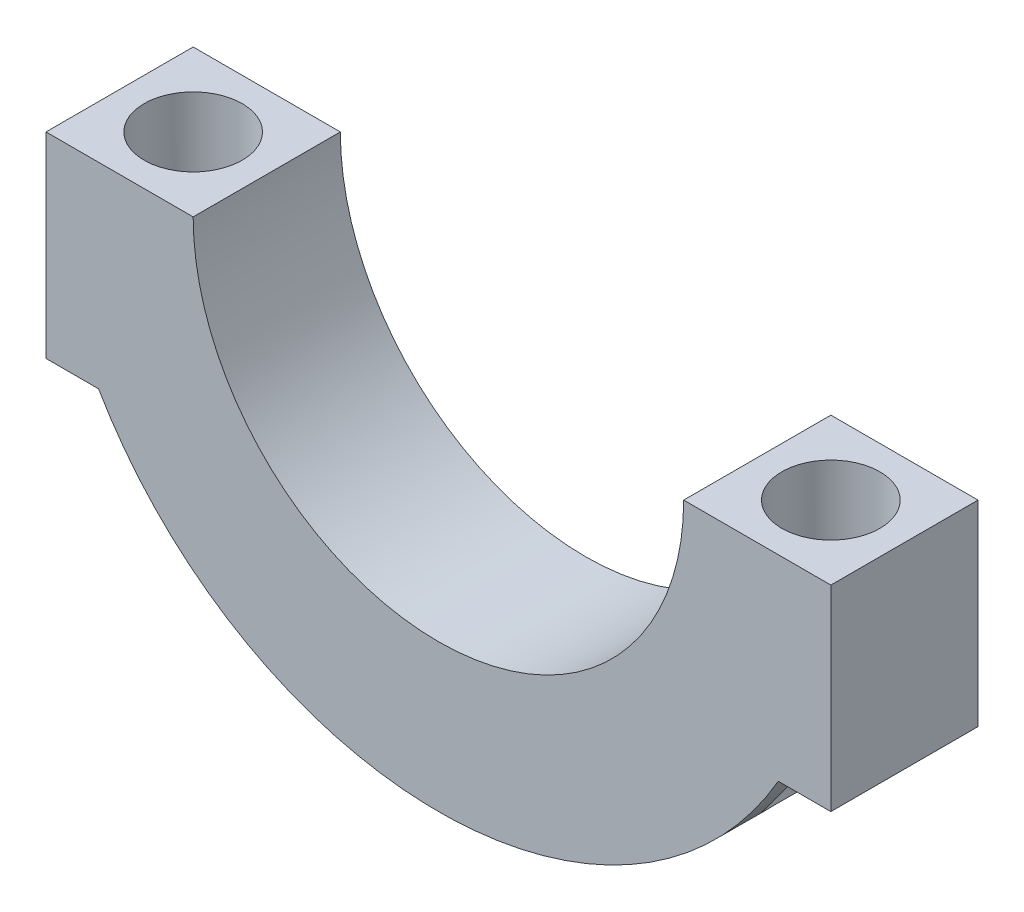
ISO-10303-21;
HEADER;
FILE_DESCRIPTION(('STEP AP214'),'2;1');
FILE_NAME('part.step','',(''),(''),'','','');
FILE_SCHEMA(('AUTOMOTIVE_DESIGN { 1 0 10303 214 1 1 1 1 }'));
ENDSEC;
DATA;
#1=APPLICATION_CONTEXT('core data for automotive mechanical design processes');
#2=APPLICATION_PROTOCOL_DEFINITION('international standard','automotive_design',2000,#1);
#3=PRODUCT_CONTEXT('',#1,'mechanical');
#4=PRODUCT('Part','Part','',(#3));
#5=PRODUCT_RELATED_PRODUCT_CATEGORY('part','',(#4));
#6=PRODUCT_DEFINITION_FORMATION('','',#4);
#7=PRODUCT_DEFINITION_CONTEXT('part definition',#1,'design');
#8=PRODUCT_DEFINITION('design','',#6,#7);
#9=PRODUCT_DEFINITION_SHAPE('','',#8);
#10=(LENGTH_UNIT() NAMED_UNIT(*) SI_UNIT(.MILLI.,.METRE.));
#11=(NAMED_UNIT(*) PLANE_ANGLE_UNIT() SI_UNIT($,.RADIAN.));
#12=(NAMED_UNIT(*) SI_UNIT($,.STERADIAN.) SOLID_ANGLE_UNIT());
#13=UNCERTAINTY_MEASURE_WITH_UNIT(LENGTH_MEASURE(1.E-05),#10,'distance_accuracy_value','');
#14=(GEOMETRIC_REPRESENTATION_CONTEXT(3) GLOBAL_UNCERTAINTY_ASSIGNED_CONTEXT((#13)) GLOBAL_UNIT_ASSIGNED_CONTEXT((#10,
#11,#12)) REPRESENTATION_CONTEXT('',''));
#15=CARTESIAN_POINT('',(0.,0.,0.));
#16=DIRECTION('',(0.,0.,1.));
#17=DIRECTION('',(1.,0.,0.));
#18=AXIS2_PLACEMENT_3D('',#15,#16,#17);
#19=CARTESIAN_POINT('',(40.000000000002,0.,15.));
#20=DIRECTION('',(-1.,0.,0.));
#21=DIRECTION('',(0.,0.,1.));
#22=AXIS2_PLACEMENT_3D('',#19,#20,#21);
#23=PLANE('',#22);
#24=DIRECTION('',(0.,1.,0.));
#25=VECTOR('',#24,1.);
#26=CARTESIAN_POINT('',(40.000000000002,0.,0.));
#27=LINE('',#26,#25);
#28=CARTESIAN_POINT('',(40.000000000002,-20.,0.));
#29=VERTEX_POINT('',#28);
#30=CARTESIAN_POINT('',(40.000000000002,0.,0.));
#31=VERTEX_POINT('',#30);
#32=EDGE_CURVE('E167',#29,#31,#27,.T.);
#33=ORIENTED_EDGE('',*,*,#32,.T.);
#34=DIRECTION('',(0.,0.,-1.));
#35=VECTOR('',#34,1.);
#36=CARTESIAN_POINT('',(40.000000000002,0.,15.));
#37=LINE('',#36,#35);
#38=CARTESIAN_POINT('',(40.000000000002,0.,15.));
#39=VERTEX_POINT('',#38);
#40=EDGE_CURVE('E119',#39,#31,#37,.T.);
#41=ORIENTED_EDGE('',*,*,#40,.F.);
#42=DIRECTION('',(0.,1.,0.));
#43=VECTOR('',#42,1.);
#44=CARTESIAN_POINT('',(40.000000000002,0.,15.));
#45=LINE('',#44,#43);
#46=CARTESIAN_POINT('',(40.000000000002,-20.,15.));
#47=VERTEX_POINT('',#46);
#48=EDGE_CURVE('E187',#47,#39,#45,.T.);
#49=ORIENTED_EDGE('',*,*,#48,.F.);
#50=DIRECTION('',(0.,0.,-1.));
#51=VECTOR('',#50,1.);
#52=CARTESIAN_POINT('',(40.000000000002,-20.,15.));
#53=LINE('',#52,#51);
#54=EDGE_CURVE('E138',#47,#29,#53,.T.);
#55=ORIENTED_EDGE('',*,*,#54,.T.);
#56=EDGE_LOOP('',(#33,#41,#49,#55));
#57=FACE_BOUND('',#56,.T.);
#58=ADVANCED_FACE('F37',(#57),#23,.F.);
#59=CARTESIAN_POINT('',(40.000000000002,0.,15.));
#60=DIRECTION('',(0.,-1.,0.));
#61=DIRECTION('',(1.,0.,0.));
#62=AXIS2_PLACEMENT_3D('',#59,#60,#61);
#63=PLANE('',#62);
#64=CARTESIAN_POINT('',(32.500000000001,0.,7.5));
#65=DIRECTION('',(0.,1.,0.));
#66=DIRECTION('',(1.,0.,0.));
#67=AXIS2_PLACEMENT_3D('',#64,#65,#66);
#68=CIRCLE('',#67,5.);
#69=CARTESIAN_POINT('',(37.500000000001,0.,7.5));
#70=VERTEX_POINT('',#69);
#71=EDGE_CURVE('E243',#70,#70,#68,.T.);
#72=ORIENTED_EDGE('',*,*,#71,.F.);
#73=EDGE_LOOP('',(#72));
#74=FACE_BOUND('',#73,.T.);
#75=DIRECTION('',(-1.,0.,0.));
#76=VECTOR('',#75,1.);
#77=CARTESIAN_POINT('',(40.000000000002,0.,0.));
#78=LINE('',#77,#76);
#79=CARTESIAN_POINT('',(25.,0.,0.));
#80=VERTEX_POINT('',#79);
#81=EDGE_CURVE('E160',#31,#80,#78,.T.);
#82=ORIENTED_EDGE('',*,*,#81,.T.);
#83=DIRECTION('',(0.,0.,-1.));
#84=VECTOR('',#83,1.);
#85=CARTESIAN_POINT('',(25.,0.,15.));
#86=LINE('',#85,#84);
#87=CARTESIAN_POINT('',(25.,0.,15.));
#88=VERTEX_POINT('',#87);
#89=EDGE_CURVE('E151',#88,#80,#86,.T.);
#90=ORIENTED_EDGE('',*,*,#89,.F.);
#91=DIRECTION('',(-1.,0.,0.));
#92=VECTOR('',#91,1.);
#93=CARTESIAN_POINT('',(40.000000000002,0.,15.));
#94=LINE('',#93,#92);
#95=EDGE_CURVE('E161',#39,#88,#94,.T.);
#96=ORIENTED_EDGE('',*,*,#95,.F.);
#97=ORIENTED_EDGE('',*,*,#40,.T.);
#98=EDGE_LOOP('',(#82,#90,#96,#97));
#99=FACE_BOUND('',#98,.T.);
#100=ADVANCED_FACE('F158',(#74,#99),#63,.F.);
#101=CARTESIAN_POINT('',(0.,0.,15.));
#102=DIRECTION('',(0.,0.,-1.));
#103=DIRECTION('',(-1.,0.,0.));
#104=AXIS2_PLACEMENT_3D('',#101,#102,#103);
#105=CYLINDRICAL_SURFACE('',#104,25.);
#106=CARTESIAN_POINT('',(0.,0.,0.));
#107=DIRECTION('',(0.,0.,-1.));
#108=DIRECTION('',(-1.,0.,0.));
#109=AXIS2_PLACEMENT_3D('',#106,#107,#108);
#110=CIRCLE('',#109,25.);
#111=CARTESIAN_POINT('',(-25.,0.,0.));
#112=VERTEX_POINT('',#111);
#113=EDGE_CURVE('E171',#80,#112,#110,.T.);
#114=ORIENTED_EDGE('',*,*,#113,.T.);
#115=DIRECTION('',(0.,0.,-1.));
#116=VECTOR('',#115,1.);
#117=CARTESIAN_POINT('',(-25.,0.,15.));
#118=LINE('',#117,#116);
#119=CARTESIAN_POINT('',(-25.,0.,15.));
#120=VERTEX_POINT('',#119);
#121=EDGE_CURVE('E148',#120,#112,#118,.T.);
#122=ORIENTED_EDGE('',*,*,#121,.F.);
#123=CARTESIAN_POINT('',(0.,0.,15.));
#124=DIRECTION('',(0.,0.,-1.));
#125=DIRECTION('',(-1.,0.,0.));
#126=AXIS2_PLACEMENT_3D('',#123,#124,#125);
#127=CIRCLE('',#126,25.);
#128=EDGE_CURVE('E190',#88,#120,#127,.T.);
#129=ORIENTED_EDGE('',*,*,#128,.F.);
#130=ORIENTED_EDGE('',*,*,#89,.T.);
#131=EDGE_LOOP('',(#114,#122,#129,#130));
#132=FACE_BOUND('',#131,.T.);
#133=ADVANCED_FACE('F215',(#132),#105,.F.);
#134=CARTESIAN_POINT('',(-40.000000000002,0.,15.));
#135=DIRECTION('',(0.,-1.,0.));
#136=DIRECTION('',(1.,0.,0.));
#137=AXIS2_PLACEMENT_3D('',#134,#135,#136);
#138=PLANE('',#137);
#139=CARTESIAN_POINT('',(-32.500000000001,0.,7.5));
#140=DIRECTION('',(0.,1.,0.));
#141=DIRECTION('',(-1.,0.,0.));
#142=AXIS2_PLACEMENT_3D('',#139,#140,#141);
#143=CIRCLE('',#142,5.);
#144=CARTESIAN_POINT('',(-37.500000000001,0.,7.5));
#145=VERTEX_POINT('',#144);
#146=EDGE_CURVE('E129',#145,#145,#143,.T.);
#147=ORIENTED_EDGE('',*,*,#146,.F.);
#148=EDGE_LOOP('',(#147));
#149=FACE_BOUND('',#148,.T.);
#150=DIRECTION('',(-1.,0.,0.));
#151=VECTOR('',#150,1.);
#152=CARTESIAN_POINT('',(-40.000000000002,0.,0.));
#153=LINE('',#152,#151);
#154=CARTESIAN_POINT('',(-40.000000000002,0.,0.));
#155=VERTEX_POINT('',#154);
#156=EDGE_CURVE('E178',#112,#155,#153,.T.);
#157=ORIENTED_EDGE('',*,*,#156,.T.);
#158=DIRECTION('',(0.,0.,-1.));
#159=VECTOR('',#158,1.);
#160=CARTESIAN_POINT('',(-40.000000000002,0.,15.));
#161=LINE('',#160,#159);
#162=CARTESIAN_POINT('',(-40.000000000002,0.,15.));
#163=VERTEX_POINT('',#162);
#164=EDGE_CURVE('E145',#163,#155,#161,.T.);
#165=ORIENTED_EDGE('',*,*,#164,.F.);
#166=DIRECTION('',(-1.,0.,0.));
#167=VECTOR('',#166,1.);
#168=CARTESIAN_POINT('',(-40.000000000002,0.,15.));
#169=LINE('',#168,#167);
#170=EDGE_CURVE('E194',#120,#163,#169,.T.);
#171=ORIENTED_EDGE('',*,*,#170,.F.);
#172=ORIENTED_EDGE('',*,*,#121,.T.);
#173=EDGE_LOOP('',(#157,#165,#171,#172));
#174=FACE_BOUND('',#173,.T.);
#175=ADVANCED_FACE('F220',(#149,#174),#138,.F.);
#176=CARTESIAN_POINT('',(-40.000000000002,0.,15.));
#177=DIRECTION('',(1.,0.,0.));
#178=DIRECTION('',(0.,0.,-1.));
#179=AXIS2_PLACEMENT_3D('',#176,#177,#178);
#180=PLANE('',#179);
#181=DIRECTION('',(0.,-1.,0.));
#182=VECTOR('',#181,1.);
#183=CARTESIAN_POINT('',(-40.000000000002,0.,0.));
#184=LINE('',#183,#182);
#185=CARTESIAN_POINT('',(-40.000000000002,-20.,0.));
#186=VERTEX_POINT('',#185);
#187=EDGE_CURVE('E180',#155,#186,#184,.T.);
#188=ORIENTED_EDGE('',*,*,#187,.T.);
#189=DIRECTION('',(0.,0.,-1.));
#190=VECTOR('',#189,1.);
#191=CARTESIAN_POINT('',(-40.000000000002,-20.,15.));
#192=LINE('',#191,#190);
#193=CARTESIAN_POINT('',(-40.000000000002,-20.,15.));
#194=VERTEX_POINT('',#193);
#195=EDGE_CURVE('E142',#194,#186,#192,.T.);
#196=ORIENTED_EDGE('',*,*,#195,.F.);
#197=DIRECTION('',(0.,-1.,0.));
#198=VECTOR('',#197,1.);
#199=CARTESIAN_POINT('',(-40.000000000002,0.,15.));
#200=LINE('',#199,#198);
#201=EDGE_CURVE('E196',#163,#194,#200,.T.);
#202=ORIENTED_EDGE('',*,*,#201,.F.);
#203=ORIENTED_EDGE('',*,*,#164,.T.);
#204=EDGE_LOOP('',(#188,#196,#202,#203));
#205=FACE_BOUND('',#204,.T.);
#206=ADVANCED_FACE('F227',(#205),#180,.F.);
#207=CARTESIAN_POINT('',(-40.000000000002,-20.,15.));
#208=DIRECTION('',(0.,1.,0.));
#209=DIRECTION('',(-1.,0.,0.));
#210=AXIS2_PLACEMENT_3D('',#207,#208,#209);
#211=PLANE('',#210);
#212=DIRECTION('',(0.,0.,-1.));
#213=VECTOR('',#212,1.);
#214=CARTESIAN_POINT('',(-34.6410161513799,-20.,15.));
#215=LINE('',#214,#213);
#216=CARTESIAN_POINT('',(-34.6410161513799,-20.,2.98158768597477));
#217=VERTEX_POINT('',#216);
#218=CARTESIAN_POINT('',(-34.6410161513799,-20.,0.));
#219=VERTEX_POINT('',#218);
#220=EDGE_CURVE('E134',#217,#219,#215,.T.);
#221=ORIENTED_EDGE('',*,*,#220,.F.);
#222=CARTESIAN_POINT('',(-32.500000000001,-20.,7.5));
#223=DIRECTION('',(0.,1.,0.));
#224=DIRECTION('',(-1.,0.,0.));
#225=AXIS2_PLACEMENT_3D('',#222,#223,#224);
#226=CIRCLE('',#225,5.);
#227=CARTESIAN_POINT('',(-34.6410161513799,-20.,12.0184123140252));
#228=VERTEX_POINT('',#227);
#229=EDGE_CURVE('E56',#217,#228,#226,.T.);
#230=ORIENTED_EDGE('',*,*,#229,.T.);
#231=CARTESIAN_POINT('',(-34.6410161513799,-20.,15.));
#232=VERTEX_POINT('',#231);
#233=EDGE_CURVE('E136',#232,#228,#215,.T.);
#234=ORIENTED_EDGE('',*,*,#233,.F.);
#235=DIRECTION('',(1.,0.,0.));
#236=VECTOR('',#235,1.);
#237=CARTESIAN_POINT('',(-40.000000000002,-20.,15.));
#238=LINE('',#237,#236);
#239=EDGE_CURVE('E198',#194,#232,#238,.T.);
#240=ORIENTED_EDGE('',*,*,#239,.F.);
#241=ORIENTED_EDGE('',*,*,#195,.T.);
#242=DIRECTION('',(1.,0.,0.));
#243=VECTOR('',#242,1.);
#244=CARTESIAN_POINT('',(-40.000000000002,-20.,0.));
#245=LINE('',#244,#243);
#246=EDGE_CURVE('E182',#186,#219,#245,.T.);
#247=ORIENTED_EDGE('',*,*,#246,.T.);
#248=EDGE_LOOP('',(#221,#230,#234,#240,#241,#247));
#249=FACE_BOUND('',#248,.T.);
#250=ADVANCED_FACE('F231',(#249),#211,.F.);
#251=CARTESIAN_POINT('',(0.,0.,15.));
#252=DIRECTION('',(0.,0.,-1.));
#253=DIRECTION('',(-1.,0.,0.));
#254=AXIS2_PLACEMENT_3D('',#251,#252,#253);
#255=CYLINDRICAL_SURFACE('',#254,40.000000000002);
#256=ORIENTED_EDGE('',*,*,#233,.T.);
#257=CARTESIAN_POINT('',(-34.6410161513799,-20.,12.0184123140252));
#258=CARTESIAN_POINT('',(-34.5387074101393,-20.1772084182309,12.0668767932615));
#259=CARTESIAN_POINT('',(-34.434631380281,-20.3543287328517,12.1119509340353));
#260=CARTESIAN_POINT('',(-34.2230097221745,-20.7081641071767,12.1951249537112));
#261=CARTESIAN_POINT('',(-34.1154636570802,-20.8848791128332,12.2332239504449));
#262=CARTESIAN_POINT('',(-33.8967089168876,-21.2380882812606,12.3023314308029));
#263=CARTESIAN_POINT('',(-33.7854914494614,-21.4145806765121,12.3333212296386));
#264=CARTESIAN_POINT('',(-33.559777271494,-21.7666048202023,12.3877751399775));
#265=CARTESIAN_POINT('',(-33.4452806755305,-21.9421366019516,12.4112395140817));
#266=CARTESIAN_POINT('',(-33.0941777457334,-22.4712236924067,12.4702922465406));
#267=CARTESIAN_POINT('',(-32.8526201948032,-22.8229669906534,12.4936815475148));
#268=CARTESIAN_POINT('',(-32.3582672712293,-23.5185927220932,12.5040945333941));
#269=CARTESIAN_POINT('',(-32.1054858930852,-23.8624841774765,12.4911623187195));
#270=CARTESIAN_POINT('',(-31.7050314922403,-24.3894902413446,12.4385094262159));
#271=CARTESIAN_POINT('',(-31.5603677802774,-24.5763839584124,12.4131824518287));
#272=CARTESIAN_POINT('',(-31.2689494699116,-24.9461048105703,12.3483817875873));
#273=CARTESIAN_POINT('',(-31.1221948371373,-25.1289318786848,12.3089078649228));
#274=CARTESIAN_POINT('',(-30.8279230903505,-25.4890776555356,12.2146534206636));
#275=CARTESIAN_POINT('',(-30.680409463292,-25.6664109150873,12.1599180193205));
#276=CARTESIAN_POINT('',(-30.3853847837617,-26.0150052128668,12.0336680651733));
#277=CARTESIAN_POINT('',(-30.2378737382581,-26.1862676158376,11.9621573113999));
#278=CARTESIAN_POINT('',(-29.9760011670677,-26.485276661901,11.8181796346916));
#279=CARTESIAN_POINT('',(-29.8613423947614,-26.6144514400463,11.7492355908533));
#280=CARTESIAN_POINT('',(-29.6339615687523,-26.8674034861417,11.5993164726661));
#281=CARTESIAN_POINT('',(-29.5212399581809,-26.9911795288183,11.5183386853804));
#282=CARTESIAN_POINT('',(-29.1879068472402,-27.3527431883952,11.2562981282697));
#283=CARTESIAN_POINT('',(-28.9716465368033,-27.581312291589,11.0558756151508));
#284=CARTESIAN_POINT('',(-28.6203609972207,-27.9449582074102,10.6619121970256));
#285=CARTESIAN_POINT('',(-28.4793122693263,-28.0884927445623,10.4815297640396));
#286=CARTESIAN_POINT('',(-28.2173078499437,-28.3516814883529,10.0910713259622));
#287=CARTESIAN_POINT('',(-28.0963273100824,-28.4713652644937,9.88103264709937));
#288=CARTESIAN_POINT('',(-27.9000083871558,-28.6636584926598,9.47049040413899));
#289=CARTESIAN_POINT('',(-27.8204286239776,-28.7407822985022,9.2741757000961));
#290=CARTESIAN_POINT('',(-27.7191678592829,-28.8383410709032,8.96807706775921));
#291=CARTESIAN_POINT('',(-27.688425219663,-28.8678462897941,8.86406995663315));
#292=CARTESIAN_POINT('',(-27.6334817167565,-28.9204450235761,8.65277621857231));
#293=CARTESIAN_POINT('',(-27.6092781350505,-28.943541202944,8.54549097513461));
#294=CARTESIAN_POINT('',(-27.5677402819103,-28.9831075751354,8.3277503989293));
#295=CARTESIAN_POINT('',(-27.550445352333,-28.9995398275509,8.21728064653642));
#296=CARTESIAN_POINT('',(-27.5232663358702,-29.0253365694835,7.99466009282855));
#297=CARTESIAN_POINT('',(-27.5133790330829,-29.0347041260362,7.88251004258208));
#298=CARTESIAN_POINT('',(-27.5012081787494,-29.0462324531234,7.65742648133271));
#299=CARTESIAN_POINT('',(-27.4989247101166,-29.048393145073,7.54449296180022));
#300=CARTESIAN_POINT('',(-27.5020093532202,-29.0454727287457,7.31883079949494));
#301=CARTESIAN_POINT('',(-27.5073769611856,-29.0403920972603,7.20610214372261));
#302=CARTESIAN_POINT('',(-27.5248526567677,-29.0238284247663,6.99161949622879));
#303=CARTESIAN_POINT('',(-27.5363308242239,-29.0129435745377,6.88976719911946));
#304=CARTESIAN_POINT('',(-27.5653634345194,-28.9853606232054,6.68771972019914));
#305=CARTESIAN_POINT('',(-27.5829198034747,-28.9686606793518,6.58752507423801));
#306=CARTESIAN_POINT('',(-27.644297145103,-28.9101383115765,6.29049469169839));
#307=CARTESIAN_POINT('',(-27.6968438681364,-28.8598769667319,6.09700671515673));
#308=CARTESIAN_POINT('',(-27.8243097820021,-28.7370109715928,5.71684699496148));
#309=CARTESIAN_POINT('',(-27.8999619256576,-28.6636714880443,5.53066654878273));
#310=CARTESIAN_POINT('',(-28.0688508087441,-28.4983088935632,5.17542420396078));
#311=CARTESIAN_POINT('',(-28.1620970179674,-28.406275718928,5.00637159983431));
#312=CARTESIAN_POINT('',(-28.4089298414537,-28.1598190462016,4.61216713482916));
#313=CARTESIAN_POINT('',(-28.5703802655154,-27.9963123592701,4.39760612242645));
#314=CARTESIAN_POINT('',(-28.9119338564214,-27.6434536684855,4.0081236243936));
#315=CARTESIAN_POINT('',(-29.0920757378162,-27.454047752501,3.83328690501245));
#316=CARTESIAN_POINT('',(-29.4091343327479,-27.1134736804645,3.56601368772419));
#317=CARTESIAN_POINT('',(-29.5435389087708,-26.9670257202069,3.46435343053369));
#318=CARTESIAN_POINT('',(-29.815488317095,-26.6660413817871,3.2785631758791));
#319=CARTESIAN_POINT('',(-29.9530344394467,-26.5115016458679,3.19444052910295));
#320=CARTESIAN_POINT('',(-30.2296563768815,-26.1956489720834,3.04236756957894));
#321=CARTESIAN_POINT('',(-30.3687339249806,-26.0343276157418,2.9744381003222));
#322=CARTESIAN_POINT('',(-30.6469309193524,-25.7062622881542,2.85358973619045));
#323=CARTESIAN_POINT('',(-30.7860503646872,-25.5395184304911,2.80067052712721));
#324=CARTESIAN_POINT('',(-31.1354457169143,-25.1136268545243,2.68467725825729));
#325=CARTESIAN_POINT('',(-31.3451153874583,-24.851505318134,2.63062574146336));
#326=CARTESIAN_POINT('',(-31.7597759166413,-24.3193467560304,2.55058802764902));
#327=CARTESIAN_POINT('',(-31.9647640515217,-24.0493053211339,2.52461778086839));
#328=CARTESIAN_POINT('',(-32.3686864506416,-23.5028465427625,2.49762135468227));
#329=CARTESIAN_POINT('',(-32.5676094138382,-23.226418805154,2.49663919888295));
#330=CARTESIAN_POINT('',(-32.9578673758714,-22.6692442959257,2.51717663767967));
#331=CARTESIAN_POINT('',(-33.1492046526958,-22.3884988566078,2.53868942308111));
#332=CARTESIAN_POINT('',(-33.4520521315404,-21.931804523311,2.59007678869999));
#333=CARTESIAN_POINT('',(-33.566127577598,-21.7568040673331,2.61361494346363));
#334=CARTESIAN_POINT('',(-33.7909969669722,-21.4058855278645,2.66815662323838));
#335=CARTESIAN_POINT('',(-33.9017913267934,-21.2299675642065,2.69915919610664));
#336=CARTESIAN_POINT('',(-34.1192984531089,-20.8785986314939,2.76810683232071));
#337=CARTESIAN_POINT('',(-34.2260330210595,-20.7031520266284,2.80600559255059));
#338=CARTESIAN_POINT('',(-34.4360981039065,-20.3518324379057,2.88868433067688));
#339=CARTESIAN_POINT('',(-34.5394284913829,-20.1759594383523,2.93346456579569));
#340=CARTESIAN_POINT('',(-34.6410161513799,-20.,2.98158768597477));
#341=B_SPLINE_CURVE_WITH_KNOTS('',3,(#257,#258,#259,#260,#261,#262,#263,#264,#265,#266,#267,
#268,#269,#270,#271,#272,#273,#274,#275,#276,#277,#278,#279,#280,#281,#282,#283,#284,#285,#286,
#287,#288,#289,#290,#291,#292,#293,#294,#295,#296,#297,#298,#299,#300,#301,#302,#303,#304,#305,
#306,#307,#308,#309,#310,#311,#312,#313,#314,#315,#316,#317,#318,#319,#320,#321,#322,#323,#324,
#325,#326,#327,#328,#329,#330,#331,#332,#333,#334,#335,#336,#337,#338,#339,#340),.UNSPECIFIED.,
.F.,.F.,(4,2,2,2,2,2,2,2,2,2,2,2,2,2,2,2,2,2,2,2,2,2,2,2,2,2,2,2,2,2,2,2,2,2,2,2,2,2,2,2,2,4),
(0.,0.630817742915786,1.26171521231149,1.89425231444567,2.5267673416822,3.80715090477156,
5.08598053945788,5.7986738725782,6.51137893472429,7.22199884258223,7.93245797497953,
8.48990603407302,9.04747995774159,10.1603395670243,10.9683068630105,11.7752661453832,
12.4484867047826,12.7853207659514,13.1220145821253,13.4605992916414,13.7990369247521,
14.137478248223,14.4758972886779,14.7847473032963,15.0936952788505,15.7109772211435,
16.3503367786173,16.9900414503737,17.9279891455432,18.8679198799811,19.5368512185247,
20.2060623707549,20.876130320586,21.5461842438114,22.5645723038226,23.5835385077268,
24.6042997853912,25.6247521691305,26.255268789352,26.8857050249902,27.5120548348808,
28.1384280627763),.UNSPECIFIED.);
#342=EDGE_CURVE('E11',#228,#217,#341,.T.);
#343=ORIENTED_EDGE('',*,*,#342,.T.);
#344=ORIENTED_EDGE('',*,*,#220,.T.);
#345=CARTESIAN_POINT('',(0.,0.,0.));
#346=DIRECTION('',(0.,0.,1.));
#347=DIRECTION('',(-1.,0.,0.));
#348=AXIS2_PLACEMENT_3D('',#345,#346,#347);
#349=CIRCLE('',#348,40.000000000002);
#350=CARTESIAN_POINT('',(34.6410161513799,-20.,0.));
#351=VERTEX_POINT('',#350);
#352=EDGE_CURVE('E185',#219,#351,#349,.T.);
#353=ORIENTED_EDGE('',*,*,#352,.T.);
#354=DIRECTION('',(0.,0.,-1.));
#355=VECTOR('',#354,1.);
#356=CARTESIAN_POINT('',(34.6410161513799,-20.,15.));
#357=LINE('',#356,#355);
#358=CARTESIAN_POINT('',(34.6410161513799,-20.,2.98158768597476));
#359=VERTEX_POINT('',#358);
#360=EDGE_CURVE('E128',#359,#351,#357,.T.);
#361=ORIENTED_EDGE('',*,*,#360,.F.);
#362=CARTESIAN_POINT('',(34.6410161513799,-20.,2.98158768597476));
#363=CARTESIAN_POINT('',(34.5387074101393,-20.1772084182309,2.93312320673854));
#364=CARTESIAN_POINT('',(34.434631380281,-20.3543287328517,2.88804906596473));
#365=CARTESIAN_POINT('',(34.2230097221745,-20.7081641071767,2.80487504628877));
#366=CARTESIAN_POINT('',(34.1154636570802,-20.8848791128332,2.76677604955511));
#367=CARTESIAN_POINT('',(33.8967089168876,-21.2380882812606,2.69766856919715));
#368=CARTESIAN_POINT('',(33.7854914494614,-21.4145806765121,2.66667877036137));
#369=CARTESIAN_POINT('',(33.559777271494,-21.7666048202022,2.61222486002248));
#370=CARTESIAN_POINT('',(33.4452806755305,-21.9421366019515,2.58876048591833));
#371=CARTESIAN_POINT('',(33.0941777457334,-22.4712236924067,2.52970775345944));
#372=CARTESIAN_POINT('',(32.8526201948032,-22.8229669906533,2.50631845248517));
#373=CARTESIAN_POINT('',(32.3582672712293,-23.5185927220932,2.49590546660593));
#374=CARTESIAN_POINT('',(32.1054858930852,-23.8624841774765,2.50883768128049));
#375=CARTESIAN_POINT('',(31.7050314922403,-24.3894902413446,2.56149057378412));
#376=CARTESIAN_POINT('',(31.5603677802774,-24.5763839584124,2.5868175481713));
#377=CARTESIAN_POINT('',(31.2689494699116,-24.9461048105703,2.65161821241273));
#378=CARTESIAN_POINT('',(31.1221948371374,-25.1289318786848,2.69109213507722));
#379=CARTESIAN_POINT('',(30.8279230903505,-25.4890776555356,2.78534657933639));
#380=CARTESIAN_POINT('',(30.6804094632921,-25.6664109150873,2.84008198067951));
#381=CARTESIAN_POINT('',(30.3853847837617,-26.0150052128667,2.9663319348267));
#382=CARTESIAN_POINT('',(30.2378737382581,-26.1862676158376,3.03784268860013));
#383=CARTESIAN_POINT('',(29.9760011670677,-26.485276661901,3.18182036530841));
#384=CARTESIAN_POINT('',(29.8613423947614,-26.6144514400463,3.25076440914666));
#385=CARTESIAN_POINT('',(29.6339615687523,-26.8674034861417,3.40068352733394));
#386=CARTESIAN_POINT('',(29.5212399581809,-26.9911795288183,3.48166131461958));
#387=CARTESIAN_POINT('',(29.1879068472402,-27.3527431883952,3.74370187173033));
#388=CARTESIAN_POINT('',(28.9716465368033,-27.581312291589,3.94412438484925));
#389=CARTESIAN_POINT('',(28.6203609972207,-27.9449582074102,4.33808780297441));
#390=CARTESIAN_POINT('',(28.4793122693263,-28.0884927445622,4.51847023596041));
#391=CARTESIAN_POINT('',(28.2173078499437,-28.3516814883529,4.90892867403784));
#392=CARTESIAN_POINT('',(28.0963273100824,-28.4713652644937,5.11896735290063));
#393=CARTESIAN_POINT('',(27.9000083871558,-28.6636584926598,5.52950959586101));
#394=CARTESIAN_POINT('',(27.8204286239777,-28.7407822985022,5.7258242999039));
#395=CARTESIAN_POINT('',(27.719167859283,-28.8383410709032,6.03192293224079));
#396=CARTESIAN_POINT('',(27.688425219663,-28.8678462897941,6.13593004336685));
#397=CARTESIAN_POINT('',(27.6334817167565,-28.9204450235761,6.34722378142769));
#398=CARTESIAN_POINT('',(27.6092781350505,-28.943541202944,6.45450902486539));
#399=CARTESIAN_POINT('',(27.5677402819103,-28.9831075751354,6.67224960107069));
#400=CARTESIAN_POINT('',(27.550445352333,-28.9995398275509,6.78271935346357));
#401=CARTESIAN_POINT('',(27.5232663358702,-29.0253365694835,7.00533990717144));
#402=CARTESIAN_POINT('',(27.5133790330829,-29.0347041260362,7.11748995741792));
#403=CARTESIAN_POINT('',(27.5012081787495,-29.0462324531233,7.34257351866728));
#404=CARTESIAN_POINT('',(27.4989247101166,-29.048393145073,7.45550703819978));
#405=CARTESIAN_POINT('',(27.5020093532202,-29.0454727287457,7.68116920050505));
#406=CARTESIAN_POINT('',(27.5073769611856,-29.0403920972603,7.79389785627739));
#407=CARTESIAN_POINT('',(27.5248526567677,-29.0238284247663,8.00838050377121));
#408=CARTESIAN_POINT('',(27.5363308242239,-29.0129435745377,8.11023280088053));
#409=CARTESIAN_POINT('',(27.5653634345194,-28.9853606232054,8.31228027980086));
#410=CARTESIAN_POINT('',(27.5829198034747,-28.9686606793518,8.41247492576198));
#411=CARTESIAN_POINT('',(27.644297145103,-28.9101383115765,8.70950530830161));
#412=CARTESIAN_POINT('',(27.6968438681365,-28.8598769667319,8.90299328484327));
#413=CARTESIAN_POINT('',(27.8243097820021,-28.7370109715928,9.28315300503851));
#414=CARTESIAN_POINT('',(27.8999619256576,-28.6636714880443,9.46933345121727));
#415=CARTESIAN_POINT('',(28.0688508087441,-28.4983088935632,9.82457579603921));
#416=CARTESIAN_POINT('',(28.1620970179674,-28.406275718928,9.99362840016568));
#417=CARTESIAN_POINT('',(28.4089298414537,-28.1598190462016,10.3878328651708));
#418=CARTESIAN_POINT('',(28.5703802655154,-27.9963123592701,10.6023938775735));
#419=CARTESIAN_POINT('',(28.9119338564214,-27.6434536684855,10.9918763756064));
#420=CARTESIAN_POINT('',(29.0920757378162,-27.454047752501,11.1667130949875));
#421=CARTESIAN_POINT('',(29.4091343327479,-27.1134736804645,11.4339863122758));
#422=CARTESIAN_POINT('',(29.5435389087708,-26.9670257202069,11.5356465694663));
#423=CARTESIAN_POINT('',(29.815488317095,-26.6660413817871,11.7214368241209));
#424=CARTESIAN_POINT('',(29.9530344394467,-26.5115016458679,11.805559470897));
#425=CARTESIAN_POINT('',(30.2296563768815,-26.1956489720834,11.9576324304211));
#426=CARTESIAN_POINT('',(30.3687339249806,-26.0343276157418,12.0255618996778));
#427=CARTESIAN_POINT('',(30.6469309193524,-25.7062622881542,12.1464102638095));
#428=CARTESIAN_POINT('',(30.7860503646872,-25.5395184304911,12.1993294728728));
#429=CARTESIAN_POINT('',(31.1354457169143,-25.1136268545243,12.3153227417427));
#430=CARTESIAN_POINT('',(31.3451153874583,-24.851505318134,12.3693742585366));
#431=CARTESIAN_POINT('',(31.7597759166413,-24.3193467560304,12.449411972351));
#432=CARTESIAN_POINT('',(31.9647640515217,-24.0493053211339,12.4753822191316));
#433=CARTESIAN_POINT('',(32.3686864506416,-23.5028465427625,12.5023786453177));
#434=CARTESIAN_POINT('',(32.5676094138382,-23.226418805154,12.5033608011171));
#435=CARTESIAN_POINT('',(32.9578673758714,-22.6692442959257,12.4828233623203));
#436=CARTESIAN_POINT('',(33.1492046526958,-22.3884988566078,12.4613105769189));
#437=CARTESIAN_POINT('',(33.4520521315404,-21.931804523311,12.4099232113));
#438=CARTESIAN_POINT('',(33.566127577598,-21.7568040673331,12.3863850565364));
#439=CARTESIAN_POINT('',(33.7909969669722,-21.4058855278645,12.3318433767616));
#440=CARTESIAN_POINT('',(33.9017913267934,-21.2299675642064,12.3008408038934));
#441=CARTESIAN_POINT('',(34.1192984531089,-20.8785986314939,12.2318931676793));
#442=CARTESIAN_POINT('',(34.2260330210595,-20.7031520266284,12.1939944074494));
#443=CARTESIAN_POINT('',(34.4360981039065,-20.3518324379057,12.1113156693231));
#444=CARTESIAN_POINT('',(34.5394284913829,-20.1759594383523,12.0665354342043));
#445=CARTESIAN_POINT('',(34.6410161513799,-20.,12.0184123140252));
#446=B_SPLINE_CURVE_WITH_KNOTS('',3,(#362,#363,#364,#365,#366,#367,#368,#369,#370,#371,#372,
#373,#374,#375,#376,#377,#378,#379,#380,#381,#382,#383,#384,#385,#386,#387,#388,#389,#390,#391,
#392,#393,#394,#395,#396,#397,#398,#399,#400,#401,#402,#403,#404,#405,#406,#407,#408,#409,#410,
#411,#412,#413,#414,#415,#416,#417,#418,#419,#420,#421,#422,#423,#424,#425,#426,#427,#428,#429,
#430,#431,#432,#433,#434,#435,#436,#437,#438,#439,#440,#441,#442,#443,#444,#445),.UNSPECIFIED.,
.F.,.F.,(4,2,2,2,2,2,2,2,2,2,2,2,2,2,2,2,2,2,2,2,2,2,2,2,2,2,2,2,2,2,2,2,2,2,2,2,2,2,2,2,2,4),
(0.,0.63081774291578,1.26171521231149,1.89425231444567,2.5267673416822,3.80715090477156,
5.08598053945788,5.79867387257821,6.5113789347243,7.22199884258223,7.93245797497954,
8.48990603407303,9.0474799577416,10.1603395670243,10.9683068630105,11.7752661453832,
12.4484867047826,12.7853207659514,13.1220145821253,13.4605992916414,13.7990369247521,
14.137478248223,14.4758972886779,14.7847473032963,15.0936952788505,15.7109772211435,
16.3503367786173,16.9900414503737,17.9279891455431,18.867919879981,19.5368512185247,
20.2060623707549,20.876130320586,21.5461842438114,22.5645723038226,23.5835385077268,
24.6042997853912,25.6247521691305,26.255268789352,26.8857050249902,27.5120548348808,
28.1384280627763),.UNSPECIFIED.);
#447=CARTESIAN_POINT('',(34.6410161513799,-20.,12.0184123140252));
#448=VERTEX_POINT('',#447);
#449=EDGE_CURVE('E62',#359,#448,#446,.T.);
#450=ORIENTED_EDGE('',*,*,#449,.T.);
#451=CARTESIAN_POINT('',(34.6410161513799,-20.,15.));
#452=VERTEX_POINT('',#451);
#453=EDGE_CURVE('E125',#452,#448,#357,.T.);
#454=ORIENTED_EDGE('',*,*,#453,.F.);
#455=CARTESIAN_POINT('',(0.,0.,15.));
#456=DIRECTION('',(0.,0.,1.));
#457=DIRECTION('',(-1.,0.,0.));
#458=AXIS2_PLACEMENT_3D('',#455,#456,#457);
#459=CIRCLE('',#458,40.000000000002);
#460=EDGE_CURVE('E199',#232,#452,#459,.T.);
#461=ORIENTED_EDGE('',*,*,#460,.F.);
#462=EDGE_LOOP('',(#256,#343,#344,#353,#361,#450,#454,#461));
#463=FACE_BOUND('',#462,.T.);
#464=ADVANCED_FACE('F123',(#463),#255,.T.);
#465=CARTESIAN_POINT('',(40.000000000002,-20.,15.));
#466=DIRECTION('',(0.,1.,0.));
#467=DIRECTION('',(-1.,0.,0.));
#468=AXIS2_PLACEMENT_3D('',#465,#466,#467);
#469=PLANE('',#468);
#470=ORIENTED_EDGE('',*,*,#453,.T.);
#471=CARTESIAN_POINT('',(32.500000000001,-20.,7.5));
#472=DIRECTION('',(0.,1.,0.));
#473=DIRECTION('',(-1.,0.,0.));
#474=AXIS2_PLACEMENT_3D('',#471,#472,#473);
#475=CIRCLE('',#474,5.);
#476=EDGE_CURVE('E50',#448,#359,#475,.T.);
#477=ORIENTED_EDGE('',*,*,#476,.T.);
#478=ORIENTED_EDGE('',*,*,#360,.T.);
#479=DIRECTION('',(1.,0.,0.));
#480=VECTOR('',#479,1.);
#481=CARTESIAN_POINT('',(40.000000000002,-20.,0.));
#482=LINE('',#481,#480);
#483=EDGE_CURVE('E186',#351,#29,#482,.T.);
#484=ORIENTED_EDGE('',*,*,#483,.T.);
#485=ORIENTED_EDGE('',*,*,#54,.F.);
#486=DIRECTION('',(1.,0.,0.));
#487=VECTOR('',#486,1.);
#488=CARTESIAN_POINT('',(40.000000000002,-20.,15.));
#489=LINE('',#488,#487);
#490=EDGE_CURVE('E133',#452,#47,#489,.T.);
#491=ORIENTED_EDGE('',*,*,#490,.F.);
#492=EDGE_LOOP('',(#470,#477,#478,#484,#485,#491));
#493=FACE_BOUND('',#492,.T.);
#494=ADVANCED_FACE('F131',(#493),#469,.F.);
#495=CARTESIAN_POINT('',(0.,0.,15.));
#496=DIRECTION('',(0.,0.,-1.));
#497=DIRECTION('',(-1.,0.,0.));
#498=AXIS2_PLACEMENT_3D('',#495,#496,#497);
#499=PLANE('',#498);
#500=ORIENTED_EDGE('',*,*,#48,.T.);
#501=ORIENTED_EDGE('',*,*,#95,.T.);
#502=ORIENTED_EDGE('',*,*,#128,.T.);
#503=ORIENTED_EDGE('',*,*,#170,.T.);
#504=ORIENTED_EDGE('',*,*,#201,.T.);
#505=ORIENTED_EDGE('',*,*,#239,.T.);
#506=ORIENTED_EDGE('',*,*,#460,.T.);
#507=ORIENTED_EDGE('',*,*,#490,.T.);
#508=EDGE_LOOP('',(#500,#501,#502,#503,#504,#505,#506,#507));
#509=FACE_BOUND('',#508,.T.);
#510=ADVANCED_FACE('F200',(#509),#499,.F.);
#511=CARTESIAN_POINT('',(0.,0.,0.));
#512=DIRECTION('',(0.,0.,-1.));
#513=DIRECTION('',(-1.,0.,0.));
#514=AXIS2_PLACEMENT_3D('',#511,#512,#513);
#515=PLANE('',#514);
#516=ORIENTED_EDGE('',*,*,#32,.F.);
#517=ORIENTED_EDGE('',*,*,#483,.F.);
#518=ORIENTED_EDGE('',*,*,#352,.F.);
#519=ORIENTED_EDGE('',*,*,#246,.F.);
#520=ORIENTED_EDGE('',*,*,#187,.F.);
#521=ORIENTED_EDGE('',*,*,#156,.F.);
#522=ORIENTED_EDGE('',*,*,#113,.F.);
#523=ORIENTED_EDGE('',*,*,#81,.F.);
#524=EDGE_LOOP('',(#516,#517,#518,#519,#520,#521,#522,#523));
#525=FACE_BOUND('',#524,.T.);
#526=ADVANCED_FACE('F202',(#525),#515,.T.);
#527=CARTESIAN_POINT('',(32.500000000001,-40.000000000002,7.5));
#528=DIRECTION('',(0.,1.,0.));
#529=DIRECTION('',(-1.,0.,0.));
#530=AXIS2_PLACEMENT_3D('',#527,#528,#529);
#531=CYLINDRICAL_SURFACE('',#530,5.);
#532=ORIENTED_EDGE('',*,*,#71,.T.);
#533=EDGE_LOOP('',(#532));
#534=FACE_BOUND('',#533,.T.);
#535=ORIENTED_EDGE('',*,*,#476,.F.);
#536=ORIENTED_EDGE('',*,*,#449,.F.);
#537=EDGE_LOOP('',(#535,#536));
#538=FACE_BOUND('',#537,.T.);
#539=ADVANCED_FACE('F115',(#534,#538),#531,.F.);
#540=CARTESIAN_POINT('',(-32.500000000001,-40.000000000002,7.5));
#541=DIRECTION('',(0.,1.,0.));
#542=DIRECTION('',(-1.,0.,0.));
#543=AXIS2_PLACEMENT_3D('',#540,#541,#542);
#544=CYLINDRICAL_SURFACE('',#543,5.);
#545=ORIENTED_EDGE('',*,*,#146,.T.);
#546=EDGE_LOOP('',(#545));
#547=FACE_BOUND('',#546,.T.);
#548=ORIENTED_EDGE('',*,*,#342,.F.);
#549=ORIENTED_EDGE('',*,*,#229,.F.);
#550=EDGE_LOOP('',(#548,#549));
#551=FACE_BOUND('',#550,.T.);
#552=ADVANCED_FACE('F247',(#547,#551),#544,.F.);
#553=CLOSED_SHELL('',(#58,#100,#133,#175,#206,#250,#464,#494,#510,#526,#539,#552));
#554=MANIFOLD_SOLID_BREP('B2',#553);
#555=ADVANCED_BREP_SHAPE_REPRESENTATION('',(#18,#554),#14);
#556=SHAPE_DEFINITION_REPRESENTATION(#9,#555);
ENDSEC;
END-ISO-10303-21;
